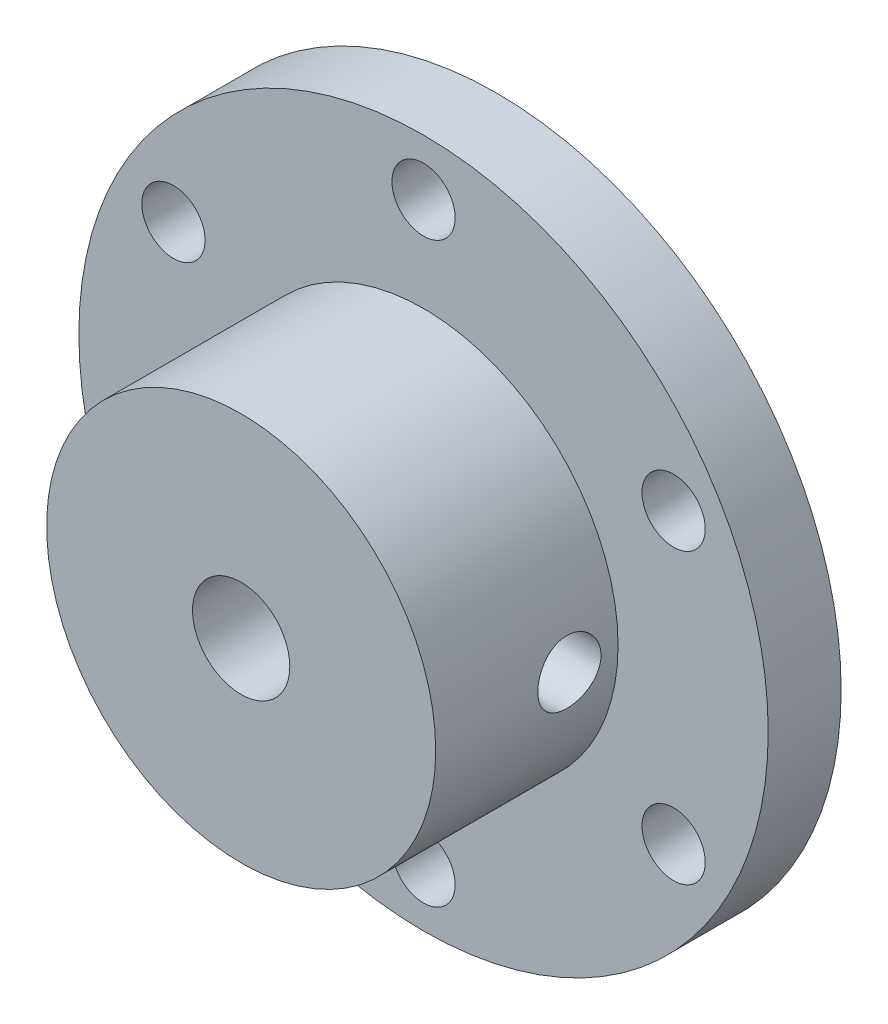
ISO-10303-21;
HEADER;
FILE_DESCRIPTION(('STEP AP214'),'2;1');
FILE_NAME('part.step','',(''),(''),'','','');
FILE_SCHEMA(('AUTOMOTIVE_DESIGN { 1 0 10303 214 1 1 1 1 }'));
ENDSEC;
DATA;
#1=APPLICATION_CONTEXT('core data for automotive mechanical design processes');
#2=APPLICATION_PROTOCOL_DEFINITION('international standard','automotive_design',2000,#1);
#3=PRODUCT_CONTEXT('',#1,'mechanical');
#4=PRODUCT('Part','Part','',(#3));
#5=PRODUCT_RELATED_PRODUCT_CATEGORY('part','',(#4));
#6=PRODUCT_DEFINITION_FORMATION('','',#4);
#7=PRODUCT_DEFINITION_CONTEXT('part definition',#1,'design');
#8=PRODUCT_DEFINITION('design','',#6,#7);
#9=PRODUCT_DEFINITION_SHAPE('','',#8);
#10=(LENGTH_UNIT() NAMED_UNIT(*) SI_UNIT(.MILLI.,.METRE.));
#11=(NAMED_UNIT(*) PLANE_ANGLE_UNIT() SI_UNIT($,.RADIAN.));
#12=(NAMED_UNIT(*) SI_UNIT($,.STERADIAN.) SOLID_ANGLE_UNIT());
#13=UNCERTAINTY_MEASURE_WITH_UNIT(LENGTH_MEASURE(1.E-05),#10,'distance_accuracy_value','');
#14=(GEOMETRIC_REPRESENTATION_CONTEXT(3) GLOBAL_UNCERTAINTY_ASSIGNED_CONTEXT((#13)) GLOBAL_UNIT_ASSIGNED_CONTEXT((#10,
#11,#12)) REPRESENTATION_CONTEXT('',''));
#15=CARTESIAN_POINT('',(0.,0.,0.));
#16=DIRECTION('',(0.,0.,1.));
#17=DIRECTION('',(1.,0.,0.));
#18=AXIS2_PLACEMENT_3D('',#15,#16,#17);
#19=CARTESIAN_POINT('',(0.,0.,6.));
#20=DIRECTION('',(0.,0.,-1.));
#21=DIRECTION('',(-1.,0.,0.));
#22=AXIS2_PLACEMENT_3D('',#19,#20,#21);
#23=CYLINDRICAL_SURFACE('',#22,28.35);
#24=CARTESIAN_POINT('',(0.,0.,6.));
#25=DIRECTION('',(0.,0.,1.));
#26=DIRECTION('',(1.,0.,0.));
#27=AXIS2_PLACEMENT_3D('',#24,#25,#26);
#28=CIRCLE('',#27,28.35);
#29=CARTESIAN_POINT('',(28.35,0.,6.));
#30=VERTEX_POINT('',#29);
#31=EDGE_CURVE('E51',#30,#30,#28,.T.);
#32=ORIENTED_EDGE('',*,*,#31,.F.);
#33=EDGE_LOOP('',(#32));
#34=FACE_BOUND('',#33,.T.);
#35=CARTESIAN_POINT('',(0.,0.,0.));
#36=DIRECTION('',(0.,0.,1.));
#37=DIRECTION('',(1.,0.,0.));
#38=AXIS2_PLACEMENT_3D('',#35,#36,#37);
#39=CIRCLE('',#38,28.35);
#40=CARTESIAN_POINT('',(28.35,0.,0.));
#41=VERTEX_POINT('',#40);
#42=EDGE_CURVE('E55',#41,#41,#39,.T.);
#43=ORIENTED_EDGE('',*,*,#42,.T.);
#44=EDGE_LOOP('',(#43));
#45=FACE_BOUND('',#44,.T.);
#46=ADVANCED_FACE('F45',(#34,#45),#23,.T.);
#47=CARTESIAN_POINT('',(0.,0.,6.));
#48=DIRECTION('',(0.,0.,1.));
#49=DIRECTION('',(1.,0.,0.));
#50=AXIS2_PLACEMENT_3D('',#47,#48,#49);
#51=PLANE('',#50);
#52=CARTESIAN_POINT('',(-20.5681033398804,-11.8750000000001,6.));
#53=DIRECTION('',(0.,0.,1.));
#54=DIRECTION('',(-0.500000000000004,0.866025403784436,0.));
#55=AXIS2_PLACEMENT_3D('',#52,#53,#54);
#56=CIRCLE('',#55,2.6);
#57=CARTESIAN_POINT('',(-21.8681033398804,-9.62333395016056,6.));
#58=VERTEX_POINT('',#57);
#59=EDGE_CURVE('E106',#58,#58,#56,.T.);
#60=ORIENTED_EDGE('',*,*,#59,.F.);
#61=EDGE_LOOP('',(#60));
#62=FACE_BOUND('',#61,.T.);
#63=CARTESIAN_POINT('',(0.,-23.75,6.));
#64=DIRECTION('',(0.,0.,1.));
#65=DIRECTION('',(-1.,0.,0.));
#66=AXIS2_PLACEMENT_3D('',#63,#64,#65);
#67=CIRCLE('',#66,2.6);
#68=CARTESIAN_POINT('',(-2.6,-23.75,6.));
#69=VERTEX_POINT('',#68);
#70=EDGE_CURVE('E100',#69,#69,#67,.T.);
#71=ORIENTED_EDGE('',*,*,#70,.F.);
#72=EDGE_LOOP('',(#71));
#73=FACE_BOUND('',#72,.T.);
#74=CARTESIAN_POINT('',(20.5681033398805,-11.8749999999998,6.));
#75=DIRECTION('',(0.,0.,1.));
#76=DIRECTION('',(-0.499999999999992,-0.866025403784443,0.));
#77=AXIS2_PLACEMENT_3D('',#74,#75,#76);
#78=CIRCLE('',#77,2.6);
#79=CARTESIAN_POINT('',(19.2681033398806,-14.1266660498394,6.));
#80=VERTEX_POINT('',#79);
#81=EDGE_CURVE('E92',#80,#80,#78,.T.);
#82=ORIENTED_EDGE('',*,*,#81,.F.);
#83=EDGE_LOOP('',(#82));
#84=FACE_BOUND('',#83,.T.);
#85=CARTESIAN_POINT('',(20.5681033398803,11.8750000000002,6.));
#86=DIRECTION('',(0.,0.,1.));
#87=DIRECTION('',(0.50000000000001,-0.866025403784433,0.));
#88=AXIS2_PLACEMENT_3D('',#85,#86,#87);
#89=CIRCLE('',#88,2.6);
#90=CARTESIAN_POINT('',(21.8681033398803,9.62333395016071,6.));
#91=VERTEX_POINT('',#90);
#92=EDGE_CURVE('E93',#91,#91,#89,.T.);
#93=ORIENTED_EDGE('',*,*,#92,.F.);
#94=EDGE_LOOP('',(#93));
#95=FACE_BOUND('',#94,.T.);
#96=CARTESIAN_POINT('',(-20.5681033398804,11.875,6.));
#97=DIRECTION('',(0.,0.,1.));
#98=DIRECTION('',(0.499999999999998,0.86602540378444,0.));
#99=AXIS2_PLACEMENT_3D('',#96,#97,#98);
#100=CIRCLE('',#99,2.6);
#101=CARTESIAN_POINT('',(-19.2681033398805,14.1266660498395,6.));
#102=VERTEX_POINT('',#101);
#103=EDGE_CURVE('E85',#102,#102,#100,.T.);
#104=ORIENTED_EDGE('',*,*,#103,.F.);
#105=EDGE_LOOP('',(#104));
#106=FACE_BOUND('',#105,.T.);
#107=CARTESIAN_POINT('',(0.,23.75,6.));
#108=DIRECTION('',(0.,0.,1.));
#109=DIRECTION('',(1.,0.,0.));
#110=AXIS2_PLACEMENT_3D('',#107,#108,#109);
#111=CIRCLE('',#110,2.6);
#112=CARTESIAN_POINT('',(2.6,23.75,6.));
#113=VERTEX_POINT('',#112);
#114=EDGE_CURVE('E79',#113,#113,#111,.T.);
#115=ORIENTED_EDGE('',*,*,#114,.F.);
#116=EDGE_LOOP('',(#115));
#117=FACE_BOUND('',#116,.T.);
#118=CARTESIAN_POINT('',(0.,0.,6.));
#119=DIRECTION('',(0.,0.,1.));
#120=DIRECTION('',(1.,0.,0.));
#121=AXIS2_PLACEMENT_3D('',#118,#119,#120);
#122=CIRCLE('',#121,16.);
#123=CARTESIAN_POINT('',(16.,0.,6.));
#124=VERTEX_POINT('',#123);
#125=EDGE_CURVE('E62',#124,#124,#122,.T.);
#126=ORIENTED_EDGE('',*,*,#125,.F.);
#127=EDGE_LOOP('',(#126));
#128=FACE_BOUND('',#127,.T.);
#129=ORIENTED_EDGE('',*,*,#31,.T.);
#130=EDGE_LOOP('',(#129));
#131=FACE_BOUND('',#130,.T.);
#132=ADVANCED_FACE('F174',(#62,#73,#84,#95,#106,#117,#128,#131),#51,.T.);
#133=CARTESIAN_POINT('',(0.,0.,0.));
#134=DIRECTION('',(0.,0.,1.));
#135=DIRECTION('',(1.,0.,0.));
#136=AXIS2_PLACEMENT_3D('',#133,#134,#135);
#137=PLANE('',#136);
#138=CARTESIAN_POINT('',(-20.5681033398804,-11.8750000000001,0.));
#139=DIRECTION('',(0.,0.,1.));
#140=DIRECTION('',(-0.500000000000004,0.866025403784436,0.));
#141=AXIS2_PLACEMENT_3D('',#138,#139,#140);
#142=CIRCLE('',#141,2.6);
#143=CARTESIAN_POINT('',(-21.8681033398804,-9.62333395016056,0.));
#144=VERTEX_POINT('',#143);
#145=EDGE_CURVE('E88',#144,#144,#142,.F.);
#146=ORIENTED_EDGE('',*,*,#145,.F.);
#147=EDGE_LOOP('',(#146));
#148=FACE_BOUND('',#147,.T.);
#149=CARTESIAN_POINT('',(0.,-23.75,0.));
#150=DIRECTION('',(0.,0.,1.));
#151=DIRECTION('',(-1.,0.,0.));
#152=AXIS2_PLACEMENT_3D('',#149,#150,#151);
#153=CIRCLE('',#152,2.6);
#154=CARTESIAN_POINT('',(-2.6,-23.75,0.));
#155=VERTEX_POINT('',#154);
#156=EDGE_CURVE('E103',#155,#155,#153,.F.);
#157=ORIENTED_EDGE('',*,*,#156,.F.);
#158=EDGE_LOOP('',(#157));
#159=FACE_BOUND('',#158,.T.);
#160=CARTESIAN_POINT('',(20.5681033398805,-11.8749999999998,0.));
#161=DIRECTION('',(0.,0.,1.));
#162=DIRECTION('',(-0.499999999999992,-0.866025403784443,0.));
#163=AXIS2_PLACEMENT_3D('',#160,#161,#162);
#164=CIRCLE('',#163,2.6);
#165=CARTESIAN_POINT('',(19.2681033398806,-14.1266660498394,0.));
#166=VERTEX_POINT('',#165);
#167=EDGE_CURVE('E97',#166,#166,#164,.F.);
#168=ORIENTED_EDGE('',*,*,#167,.F.);
#169=EDGE_LOOP('',(#168));
#170=FACE_BOUND('',#169,.T.);
#171=CARTESIAN_POINT('',(20.5681033398803,11.8750000000002,0.));
#172=DIRECTION('',(0.,0.,1.));
#173=DIRECTION('',(0.50000000000001,-0.866025403784433,0.));
#174=AXIS2_PLACEMENT_3D('',#171,#172,#173);
#175=CIRCLE('',#174,2.6);
#176=CARTESIAN_POINT('',(21.8681033398803,9.62333395016071,0.));
#177=VERTEX_POINT('',#176);
#178=EDGE_CURVE('E89',#177,#177,#175,.F.);
#179=ORIENTED_EDGE('',*,*,#178,.F.);
#180=EDGE_LOOP('',(#179));
#181=FACE_BOUND('',#180,.T.);
#182=CARTESIAN_POINT('',(-20.5681033398804,11.875,0.));
#183=DIRECTION('',(0.,0.,1.));
#184=DIRECTION('',(0.499999999999998,0.86602540378444,0.));
#185=AXIS2_PLACEMENT_3D('',#182,#183,#184);
#186=CIRCLE('',#185,2.6);
#187=CARTESIAN_POINT('',(-19.2681033398805,14.1266660498395,0.));
#188=VERTEX_POINT('',#187);
#189=EDGE_CURVE('E82',#188,#188,#186,.F.);
#190=ORIENTED_EDGE('',*,*,#189,.F.);
#191=EDGE_LOOP('',(#190));
#192=FACE_BOUND('',#191,.T.);
#193=CARTESIAN_POINT('',(0.,23.75,0.));
#194=DIRECTION('',(0.,0.,1.));
#195=DIRECTION('',(1.,0.,0.));
#196=AXIS2_PLACEMENT_3D('',#193,#194,#195);
#197=CIRCLE('',#196,2.6);
#198=CARTESIAN_POINT('',(2.6,23.75,0.));
#199=VERTEX_POINT('',#198);
#200=EDGE_CURVE('E74',#199,#199,#197,.F.);
#201=ORIENTED_EDGE('',*,*,#200,.F.);
#202=EDGE_LOOP('',(#201));
#203=FACE_BOUND('',#202,.T.);
#204=CARTESIAN_POINT('',(0.,0.,0.));
#205=DIRECTION('',(0.,0.,1.));
#206=DIRECTION('',(1.,0.,0.));
#207=AXIS2_PLACEMENT_3D('',#204,#205,#206);
#208=CIRCLE('',#207,11.);
#209=CARTESIAN_POINT('',(11.,0.,0.));
#210=VERTEX_POINT('',#209);
#211=EDGE_CURVE('E12',#210,#210,#208,.F.);
#212=ORIENTED_EDGE('',*,*,#211,.F.);
#213=EDGE_LOOP('',(#212));
#214=FACE_BOUND('',#213,.T.);
#215=ORIENTED_EDGE('',*,*,#42,.F.);
#216=EDGE_LOOP('',(#215));
#217=FACE_BOUND('',#216,.T.);
#218=ADVANCED_FACE('F172',(#148,#159,#170,#181,#192,#203,#214,#217),#137,.F.);
#219=CARTESIAN_POINT('',(0.,0.,21.));
#220=DIRECTION('',(0.,0.,-1.));
#221=DIRECTION('',(-1.,0.,0.));
#222=AXIS2_PLACEMENT_3D('',#219,#220,#221);
#223=CYLINDRICAL_SURFACE('',#222,16.);
#224=CARTESIAN_POINT('',(16.,0.,7.4));
#225=CARTESIAN_POINT('',(15.9999975518525,0.145019165622541,7.400005860033));
#226=CARTESIAN_POINT('',(15.998007815557,0.290118777639167,7.41217399437673));
#227=CARTESIAN_POINT('',(15.9902619371879,0.576252000590273,7.46050684932739));
#228=CARTESIAN_POINT('',(15.9845022787969,0.717281687035817,7.49669397359803));
#229=CARTESIAN_POINT('',(15.9698628987647,0.991093594297769,7.59194634492627));
#230=CARTESIAN_POINT('',(15.9609856797801,1.12388233031244,7.65099324492504));
#231=CARTESIAN_POINT('',(15.941088512354,1.37764964720681,7.79024181657666));
#232=CARTESIAN_POINT('',(15.9300688225734,1.49862965111127,7.87044093493452));
#233=CARTESIAN_POINT('',(15.9069970915093,1.72646494930587,8.05049468884231));
#234=CARTESIAN_POINT('',(15.8949373686679,1.83319709427538,8.15050418657474));
#235=CARTESIAN_POINT('',(15.8712039142321,2.02844349150952,8.3670064758371));
#236=CARTESIAN_POINT('',(15.859530206462,2.1169566210824,8.48350028241674));
#237=CARTESIAN_POINT('',(15.8378161048365,2.27374233291168,8.73050557038933));
#238=CARTESIAN_POINT('',(15.8277856376571,2.34189381199137,8.86109487026781));
#239=CARTESIAN_POINT('',(15.8105998564937,2.45524735239402,9.13205768923801));
#240=CARTESIAN_POINT('',(15.8034443581267,2.50045088550628,9.27243058019251));
#241=CARTESIAN_POINT('',(15.7928949187579,2.5662387819247,9.55767306751007));
#242=CARTESIAN_POINT('',(15.7894685806565,2.58703530727345,9.70249251051031));
#243=CARTESIAN_POINT('',(15.7866673145195,2.60407651839143,9.99360287646867));
#244=CARTESIAN_POINT('',(15.7872921138754,2.60032285618713,10.1398936997535));
#245=CARTESIAN_POINT('',(15.792492936895,2.5685432048478,10.4282837553786));
#246=CARTESIAN_POINT('',(15.7970302480111,2.54075501837767,10.5704099922873));
#247=CARTESIAN_POINT('',(15.8094842884277,2.46206807385545,10.8479556544906));
#248=CARTESIAN_POINT('',(15.8174011283977,2.41116855897298,10.9833748599879));
#249=CARTESIAN_POINT('',(15.8357642622092,2.28746109805666,11.2443773241013));
#250=CARTESIAN_POINT('',(15.8462219734499,2.2145538916015,11.3699126999328));
#251=CARTESIAN_POINT('',(15.8684805204019,2.04897114492228,11.6070579521655));
#252=CARTESIAN_POINT('',(15.8802814592449,1.95629408631178,11.7186667579184));
#253=CARTESIAN_POINT('',(15.9040671416711,1.75250422023619,11.9261676650082));
#254=CARTESIAN_POINT('',(15.9160524138607,1.64118727022561,12.0218593275903));
#255=CARTESIAN_POINT('',(15.9387277836054,1.40396930678376,12.1932351460248));
#256=CARTESIAN_POINT('',(15.9494178735614,1.27806820779389,12.268919184493));
#257=CARTESIAN_POINT('',(15.9683124927782,1.01507117727731,12.3981475356042));
#258=CARTESIAN_POINT('',(15.9765150982258,0.877966684577824,12.4516747238223));
#259=CARTESIAN_POINT('',(15.9894949378792,0.596550991776668,12.5348869796715));
#260=CARTESIAN_POINT('',(15.9942724443176,0.452240365405991,12.564573942186));
#261=CARTESIAN_POINT('',(15.9998273274762,0.162237052175142,12.5989926713094));
#262=CARTESIAN_POINT('',(16.0006488246688,0.0165778499538006,12.6039997024925));
#263=CARTESIAN_POINT('',(15.9983197787696,-0.273498686511127,12.5896494658514));
#264=CARTESIAN_POINT('',(15.995169380715,-0.417916065907044,12.5702930876776));
#265=CARTESIAN_POINT('',(15.9852778322002,-0.700563507141241,12.5079944292099));
#266=CARTESIAN_POINT('',(15.9785573499514,-0.838824267874382,12.4651878644649));
#267=CARTESIAN_POINT('',(15.9622763015789,-1.10620674757079,12.357348226564));
#268=CARTESIAN_POINT('',(15.9527155825726,-1.2353279741128,12.292313956919));
#269=CARTESIAN_POINT('',(15.9317056456613,-1.48196559776625,12.1412305759297));
#270=CARTESIAN_POINT('',(15.9202411780516,-1.59937491764035,12.0550088262938));
#271=CARTESIAN_POINT('',(15.8967429940485,-1.81815609227847,11.8642362281294));
#272=CARTESIAN_POINT('',(15.8847092385126,-1.91952684218722,11.759684117915));
#273=CARTESIAN_POINT('',(15.861286806495,-2.10436883201893,11.5339864162734));
#274=CARTESIAN_POINT('',(15.8499056278516,-2.1876544619935,11.4126879142364));
#275=CARTESIAN_POINT('',(15.8292151115576,-2.33266734053808,11.1576604671493));
#276=CARTESIAN_POINT('',(15.8199057106323,-2.39439524754049,11.0239319019056));
#277=CARTESIAN_POINT('',(15.8044685529145,-2.49426022583075,10.7483683048658));
#278=CARTESIAN_POINT('',(15.7983281672888,-2.53249105346396,10.6065679898655));
#279=CARTESIAN_POINT('',(15.789892100647,-2.58457259245705,10.3184507365549));
#280=CARTESIAN_POINT('',(15.7875961034369,-2.5984253088787,10.1721341707066));
#281=CARTESIAN_POINT('',(15.7871219367981,-2.60130360164379,9.88099032581017));
#282=CARTESIAN_POINT('',(15.7888953245053,-2.59062124754973,9.73616592977366));
#283=CARTESIAN_POINT('',(15.7962541732009,-2.54536271366947,9.45040383344645));
#284=CARTESIAN_POINT('',(15.8018396235564,-2.51078660053051,9.30946612231569));
#285=CARTESIAN_POINT('',(15.8161752287004,-2.41883172557042,9.03558276759314));
#286=CARTESIAN_POINT('',(15.8249220621644,-2.36147688867156,8.90262890654861));
#287=CARTESIAN_POINT('',(15.8445983040299,-2.22562239095935,8.6481834323924));
#288=CARTESIAN_POINT('',(15.855527811869,-2.14712176673498,8.52669234187001));
#289=CARTESIAN_POINT('',(15.8784920726711,-1.97015676038599,8.29714327721146));
#290=CARTESIAN_POINT('',(15.8905379049704,-1.87147711552398,8.18925234016369));
#291=CARTESIAN_POINT('',(15.9142881228198,-1.65740958299184,7.99145994230406));
#292=CARTESIAN_POINT('',(15.9259924288051,-1.54201783868795,7.90156264530333));
#293=CARTESIAN_POINT('',(15.9478291613459,-1.29690761070655,7.74177541359853));
#294=CARTESIAN_POINT('',(15.9579508180885,-1.1671004465741,7.67202003835235));
#295=CARTESIAN_POINT('',(15.9753768765635,-0.897501815361569,7.55541067805837));
#296=CARTESIAN_POINT('',(15.9826841117636,-0.757720558855373,7.50853364706595));
#297=CARTESIAN_POINT('',(15.9920442535747,-0.514478104994399,7.44930629219604));
#298=CARTESIAN_POINT('',(15.9950118750673,-0.412496524331958,7.43084568967443));
#299=CARTESIAN_POINT('',(15.9989906066281,-0.207023613848418,7.40619054922839));
#300=CARTESIAN_POINT('',(16.0000017477853,-0.103532308043563,7.39999581639614));
#301=CARTESIAN_POINT('',(16.,0.,7.4));
#302=B_SPLINE_CURVE_WITH_KNOTS('',3,(#224,#225,#226,#227,#228,#229,#230,#231,#232,#233,#234,
#235,#236,#237,#238,#239,#240,#241,#242,#243,#244,#245,#246,#247,#248,#249,#250,#251,#252,#253,
#254,#255,#256,#257,#258,#259,#260,#261,#262,#263,#264,#265,#266,#267,#268,#269,#270,#271,#272,
#273,#274,#275,#276,#277,#278,#279,#280,#281,#282,#283,#284,#285,#286,#287,#288,#289,#290,#291,
#292,#293,#294,#295,#296,#297,#298,#299,#300,#301),.UNSPECIFIED.,.T.,.F.,(4,2,2,2,2,2,2,2,2,2,2,
2,2,2,2,2,2,2,2,2,2,2,2,2,2,2,2,2,2,2,2,2,2,2,2,2,2,2,4),(0.,0.434679088417318,
0.869764193703607,1.30450082494282,1.73918500290158,2.17741177975745,2.61566555293407,
3.05647624757063,3.49725866680267,3.93418044388563,4.37107282001553,4.80369130704004,
5.23632396211356,5.67093782244235,6.10558507449936,6.54534792691676,6.98511335935419,
7.42521804273336,7.86528774197792,8.30043789444196,8.73557215749171,9.16821432936311,
9.60087979348197,10.0371949046106,10.4735400592753,10.9141714688839,11.3547894192148,
11.7936376358453,12.2324497562046,12.6660652990585,13.0996796324263,13.5328397318637,
13.9660195695974,14.4040871007936,14.8422558859345,15.2832875284259,15.7238739867125,
16.0342056881841,16.344532458366),.UNSPECIFIED.);
#303=CARTESIAN_POINT('',(16.,0.,7.4));
#304=VERTEX_POINT('',#303);
#305=EDGE_CURVE('E96',#304,#304,#302,.T.);
#306=ORIENTED_EDGE('',*,*,#305,.F.);
#307=EDGE_LOOP('',(#306));
#308=FACE_BOUND('',#307,.T.);
#309=CARTESIAN_POINT('',(0.,0.,21.));
#310=DIRECTION('',(0.,0.,1.));
#311=DIRECTION('',(1.,0.,0.));
#312=AXIS2_PLACEMENT_3D('',#309,#310,#311);
#313=CIRCLE('',#312,16.);
#314=CARTESIAN_POINT('',(16.,0.,21.));
#315=VERTEX_POINT('',#314);
#316=EDGE_CURVE('E60',#315,#315,#313,.T.);
#317=ORIENTED_EDGE('',*,*,#316,.F.);
#318=EDGE_LOOP('',(#317));
#319=FACE_BOUND('',#318,.T.);
#320=ORIENTED_EDGE('',*,*,#125,.T.);
#321=EDGE_LOOP('',(#320));
#322=FACE_BOUND('',#321,.T.);
#323=ADVANCED_FACE('F168',(#308,#319,#322),#223,.T.);
#324=CARTESIAN_POINT('',(0.,0.,21.));
#325=DIRECTION('',(0.,0.,1.));
#326=DIRECTION('',(1.,0.,0.));
#327=AXIS2_PLACEMENT_3D('',#324,#325,#326);
#328=PLANE('',#327);
#329=CARTESIAN_POINT('',(0.,0.,21.));
#330=DIRECTION('',(0.,0.,1.));
#331=DIRECTION('',(1.,0.,0.));
#332=AXIS2_PLACEMENT_3D('',#329,#330,#331);
#333=CIRCLE('',#332,4.);
#334=CARTESIAN_POINT('',(4.,0.,21.));
#335=VERTEX_POINT('',#334);
#336=EDGE_CURVE('E71',#335,#335,#333,.T.);
#337=ORIENTED_EDGE('',*,*,#336,.F.);
#338=EDGE_LOOP('',(#337));
#339=FACE_BOUND('',#338,.T.);
#340=ORIENTED_EDGE('',*,*,#316,.T.);
#341=EDGE_LOOP('',(#340));
#342=FACE_BOUND('',#341,.T.);
#343=ADVANCED_FACE('F164',(#339,#342),#328,.T.);
#344=CARTESIAN_POINT('',(0.,0.,-5.));
#345=DIRECTION('',(0.,0.,1.));
#346=DIRECTION('',(1.,0.,0.));
#347=AXIS2_PLACEMENT_3D('',#344,#345,#346);
#348=CYLINDRICAL_SURFACE('',#347,11.);
#349=CARTESIAN_POINT('',(0.,0.,-5.));
#350=DIRECTION('',(0.,0.,-1.));
#351=DIRECTION('',(-1.,0.,0.));
#352=AXIS2_PLACEMENT_3D('',#349,#350,#351);
#353=CIRCLE('',#352,11.);
#354=CARTESIAN_POINT('',(-11.,0.,-5.));
#355=VERTEX_POINT('',#354);
#356=EDGE_CURVE('E65',#355,#355,#353,.T.);
#357=ORIENTED_EDGE('',*,*,#356,.F.);
#358=EDGE_LOOP('',(#357));
#359=FACE_BOUND('',#358,.T.);
#360=ORIENTED_EDGE('',*,*,#211,.T.);
#361=EDGE_LOOP('',(#360));
#362=FACE_BOUND('',#361,.T.);
#363=ADVANCED_FACE('F160',(#359,#362),#348,.T.);
#364=CARTESIAN_POINT('',(0.,0.,-5.));
#365=DIRECTION('',(0.,0.,-1.));
#366=DIRECTION('',(-1.,0.,0.));
#367=AXIS2_PLACEMENT_3D('',#364,#365,#366);
#368=PLANE('',#367);
#369=CARTESIAN_POINT('',(0.,0.,-5.));
#370=DIRECTION('',(0.,0.,1.));
#371=DIRECTION('',(1.,0.,0.));
#372=AXIS2_PLACEMENT_3D('',#369,#370,#371);
#373=CIRCLE('',#372,4.);
#374=CARTESIAN_POINT('',(4.,0.,-5.));
#375=VERTEX_POINT('',#374);
#376=EDGE_CURVE('E70',#375,#375,#373,.T.);
#377=ORIENTED_EDGE('',*,*,#376,.T.);
#378=EDGE_LOOP('',(#377));
#379=FACE_BOUND('',#378,.T.);
#380=ORIENTED_EDGE('',*,*,#356,.T.);
#381=EDGE_LOOP('',(#380));
#382=FACE_BOUND('',#381,.T.);
#383=ADVANCED_FACE('F156',(#379,#382),#368,.T.);
#384=CARTESIAN_POINT('',(0.,0.,-5.));
#385=DIRECTION('',(0.,0.,1.));
#386=DIRECTION('',(1.,0.,0.));
#387=AXIS2_PLACEMENT_3D('',#384,#385,#386);
#388=CYLINDRICAL_SURFACE('',#387,4.);
#389=CARTESIAN_POINT('',(4.00000000000001,0.,7.4));
#390=CARTESIAN_POINT('',(3.99999329691887,-0.131242329840402,7.40000738126002));
#391=CARTESIAN_POINT('',(3.99347988058591,-0.26254087997631,7.40999708649455));
#392=CARTESIAN_POINT('',(3.96805748738894,-0.52099139192231,7.44937287000064));
#393=CARTESIAN_POINT('',(3.94913797434839,-0.648139732626245,7.47877543525755));
#394=CARTESIAN_POINT('',(3.90078759906248,-0.894153597137369,7.55520688955142));
#395=CARTESIAN_POINT('',(3.87140638518175,-1.01305512679099,7.60215257495925));
#396=CARTESIAN_POINT('',(3.8045247484509,-1.24084842839767,7.71170628677316));
#397=CARTESIAN_POINT('',(3.76702351965728,-1.3497392052146,7.77431586797862));
#398=CARTESIAN_POINT('',(3.68325347012659,-1.56461434967278,7.91910183329293));
#399=CARTESIAN_POINT('',(3.63651545151144,-1.66960870737682,8.00247034493663));
#400=CARTESIAN_POINT('',(3.54025458179931,-1.86507260364924,8.18360410574952));
#401=CARTESIAN_POINT('',(3.49072792339419,-1.9555216008489,8.28138934774511));
#402=CARTESIAN_POINT('',(3.38558669465042,-2.13305930241868,8.50552739909667));
#403=CARTESIAN_POINT('',(3.33016214511496,-2.21764773761769,8.63396599830677));
#404=CARTESIAN_POINT('',(3.22801420162754,-2.36387198159628,8.90642481317717));
#405=CARTESIAN_POINT('',(3.18127587306569,-2.42554737172189,9.05041759878877));
#406=CARTESIAN_POINT('',(3.11539311765711,-2.50925136145637,9.30955747553016));
#407=CARTESIAN_POINT('',(3.09219132576584,-2.53752995825082,9.42164521861647));
#408=CARTESIAN_POINT('',(3.05771041530277,-2.57898335699173,9.65029679368884));
#409=CARTESIAN_POINT('',(3.04641228509143,-2.59218224597557,9.7668531791267));
#410=CARTESIAN_POINT('',(3.03746806038309,-2.60266135280388,10.0016298561429));
#411=CARTESIAN_POINT('',(3.03986891717852,-2.59988682378099,10.1198544831345));
#412=CARTESIAN_POINT('',(3.05803219832116,-2.57849148954916,10.3538522603983));
#413=CARTESIAN_POINT('',(3.07380580320714,-2.55985742462454,10.46962327624));
#414=CARTESIAN_POINT('',(3.11558534759959,-2.50881501786101,10.6916580375893));
#415=CARTESIAN_POINT('',(3.14121548827324,-2.4769094003533,10.7981125106191));
#416=CARTESIAN_POINT('',(3.19981705285506,-2.40072387206794,11.0043007802708));
#417=CARTESIAN_POINT('',(3.23279089307918,-2.35643988717874,11.1040323507368));
#418=CARTESIAN_POINT('',(3.31021385739157,-2.24673614480251,11.3148988685634));
#419=CARTESIAN_POINT('',(3.3556433242705,-2.17886980217695,11.4243987256045));
#420=CARTESIAN_POINT('',(3.44875456395806,-2.02828712582731,11.631714922157));
#421=CARTESIAN_POINT('',(3.49643900487366,-1.94555285901557,11.7295169122504));
#422=CARTESIAN_POINT('',(3.59951924333919,-1.74873460092104,11.9301085195407));
#423=CARTESIAN_POINT('',(3.65461273597688,-1.63168281359842,12.0301736971629));
#424=CARTESIAN_POINT('',(3.75705675925733,-1.37948895098043,12.2092655039682));
#425=CARTESIAN_POINT('',(3.80441521846604,-1.24436566112746,12.2883137288184));
#426=CARTESIAN_POINT('',(3.87810197822686,-0.987177593697824,12.4086200970024));
#427=CARTESIAN_POINT('',(3.90673767899132,-0.867825846065371,12.4542618689402));
#428=CARTESIAN_POINT('',(3.95335158387484,-0.621803922247494,12.5278062967084));
#429=CARTESIAN_POINT('',(3.97133854602048,-0.495139854433106,12.5557235314094));
#430=CARTESIAN_POINT('',(3.99505026067922,-0.237423817982841,12.5924169717052));
#431=CARTESIAN_POINT('',(4.00072966012438,-0.106357421515167,12.6011223843623));
#432=CARTESIAN_POINT('',(3.99911931552079,0.155513974751281,12.5986452674804));
#433=CARTESIAN_POINT('',(3.9918293542577,0.286318970135309,12.5874624048472));
#434=CARTESIAN_POINT('',(3.96581617517835,0.535832409189388,12.5471382819573));
#435=CARTESIAN_POINT('',(3.94779725175815,0.654798018157413,12.5191023253737));
#436=CARTESIAN_POINT('',(3.90242300909489,0.885994589797185,12.4473811532236));
#437=CARTESIAN_POINT('',(3.87506617651225,0.998224457378542,12.4036934010065));
#438=CARTESIAN_POINT('',(3.81084256295547,1.22143058424602,12.2987741796295));
#439=CARTESIAN_POINT('',(3.77344664526003,1.3317766276134,12.2365337702525));
#440=CARTESIAN_POINT('',(3.69298130183549,1.54093180569865,12.097926552364));
#441=CARTESIAN_POINT('',(3.64990778597085,1.63973252544577,12.0215495436746));
#442=CARTESIAN_POINT('',(3.55409295784261,1.83914998324802,11.8433890522977));
#443=CARTESIAN_POINT('',(3.50088886534182,1.93766759539933,11.7395021130206));
#444=CARTESIAN_POINT('',(3.3956438319936,2.11669261988643,11.5165942077913));
#445=CARTESIAN_POINT('',(3.34360337235282,2.19719270088575,11.3975671120893));
#446=CARTESIAN_POINT('',(3.25220537921942,2.32999289851312,11.1607308489132));
#447=CARTESIAN_POINT('',(3.21207543674154,2.38451159546739,11.0444705590162));
#448=CARTESIAN_POINT('',(3.14178831224712,2.4763952519929,10.8025770418024));
#449=CARTESIAN_POINT('',(3.11161319411396,2.51379111036201,10.6769611772152));
#450=CARTESIAN_POINT('',(3.0692934895664,2.56522627052098,10.4383770125928));
#451=CARTESIAN_POINT('',(3.05511753152745,2.58193539978499,10.3263540057634));
#452=CARTESIAN_POINT('',(3.03930433313111,2.6005371868811,10.1002347008403));
#453=CARTESIAN_POINT('',(3.03765740728438,2.60244128967071,9.98614007261254));
#454=CARTESIAN_POINT('',(3.04714201327667,2.59132574649897,9.75933297558345));
#455=CARTESIAN_POINT('',(3.05826410933804,2.57831712043633,9.64661954830303));
#456=CARTESIAN_POINT('',(3.09162789439484,2.53820790097824,9.42538703012019));
#457=CARTESIAN_POINT('',(3.11388388764562,2.51108917785943,9.31687352877944));
#458=CARTESIAN_POINT('',(3.17455377484889,2.43418115457623,9.07522359122063));
#459=CARTESIAN_POINT('',(3.21579043461171,2.38007932598737,8.94417788011513));
#460=CARTESIAN_POINT('',(3.30612081416593,2.25291901658979,8.69460918405456));
#461=CARTESIAN_POINT('',(3.35522523949556,2.17983462114018,8.57610363240639));
#462=CARTESIAN_POINT('',(3.45667900495331,2.01515794084205,8.35110588997306));
#463=CARTESIAN_POINT('',(3.50906686476138,1.92329614569848,8.24482856708459));
#464=CARTESIAN_POINT('',(3.61161392590105,1.72305889643047,8.04786851587868));
#465=CARTESIAN_POINT('',(3.66177258968263,1.61467948684425,7.95718953398671));
#466=CARTESIAN_POINT('',(3.76028651184461,1.37081527561855,7.78522804376525));
#467=CARTESIAN_POINT('',(3.80795408931363,1.23370112020267,7.70580535149122));
#468=CARTESIAN_POINT('',(3.8693611012282,1.01672423622726,7.6057087030814));
#469=CARTESIAN_POINT('',(3.88814289000377,0.942542349294445,7.57552330986037));
#470=CARTESIAN_POINT('',(3.92179078701731,0.790932764694422,7.5219198025447));
#471=CARTESIAN_POINT('',(3.93665878835666,0.713506657344975,7.49849841616152));
#472=CARTESIAN_POINT('',(3.96583403439342,0.531962182410129,7.45279703410458));
#473=CARTESIAN_POINT('',(3.97857524969429,0.426930692841303,7.43306300572254));
#474=CARTESIAN_POINT('',(3.99565973196604,0.214611549942163,7.40666340225019));
#475=CARTESIAN_POINT('',(4.00000548150374,0.107324573055882,7.3999939639095));
#476=CARTESIAN_POINT('',(4.00000000000001,0.,7.4));
#477=B_SPLINE_CURVE_WITH_KNOTS('',3,(#389,#390,#391,#392,#393,#394,#395,#396,#397,#398,#399,
#400,#401,#402,#403,#404,#405,#406,#407,#408,#409,#410,#411,#412,#413,#414,#415,#416,#417,#418,
#419,#420,#421,#422,#423,#424,#425,#426,#427,#428,#429,#430,#431,#432,#433,#434,#435,#436,#437,
#438,#439,#440,#441,#442,#443,#444,#445,#446,#447,#448,#449,#450,#451,#452,#453,#454,#455,#456,
#457,#458,#459,#460,#461,#462,#463,#464,#465,#466,#467,#468,#469,#470,#471,#472,#473,#474,#475,
#476),.UNSPECIFIED.,.T.,.F.,(4,2,2,2,2,2,2,2,2,2,2,2,2,2,2,2,2,2,2,2,2,2,2,2,2,2,2,2,2,2,2,2,2,
2,2,2,2,2,2,2,2,2,2,4),(0.,0.393303969432377,0.786942395104627,1.1787370878649,1.57057068563366,
1.99490086832629,2.419825137127,2.90794425842807,3.39521620935952,3.74750251178101,
4.09922531195304,4.45215431353109,4.80537867939459,5.1462917867135,5.48731723168751,
5.89565988937284,6.30449842018327,6.79278996236955,7.28057781136886,7.67176869156947,
8.06263738930539,8.45494399662145,8.8472571744554,9.21628489699287,9.58537245408335,
9.98013330852133,10.3751801185911,10.8315540068116,11.288113257406,11.6902028988748,
12.0915640670411,12.4324642576701,12.7731008907508,13.1134859694145,13.4543094846403,
13.8949021129378,14.3360994206592,14.7841406255338,15.2322892916033,15.7254702477647,
15.9718878198455,16.2181859796628,16.5399089195223,16.8615367102804),.UNSPECIFIED.);
#478=CARTESIAN_POINT('',(4.00000000000001,0.,7.4));
#479=VERTEX_POINT('',#478);
#480=EDGE_CURVE('E120',#479,#479,#477,.T.);
#481=ORIENTED_EDGE('',*,*,#480,.F.);
#482=EDGE_LOOP('',(#481));
#483=FACE_BOUND('',#482,.T.);
#484=ORIENTED_EDGE('',*,*,#376,.F.);
#485=EDGE_LOOP('',(#484));
#486=FACE_BOUND('',#485,.T.);
#487=ORIENTED_EDGE('',*,*,#336,.T.);
#488=EDGE_LOOP('',(#487));
#489=FACE_BOUND('',#488,.T.);
#490=ADVANCED_FACE('F152',(#483,#486,#489),#388,.F.);
#491=CARTESIAN_POINT('',(0.,23.75,-5.001));
#492=DIRECTION('',(0.,0.,1.));
#493=DIRECTION('',(1.,0.,0.));
#494=AXIS2_PLACEMENT_3D('',#491,#492,#493);
#495=CYLINDRICAL_SURFACE('',#494,2.6);
#496=ORIENTED_EDGE('',*,*,#114,.T.);
#497=EDGE_LOOP('',(#496));
#498=FACE_BOUND('',#497,.T.);
#499=ORIENTED_EDGE('',*,*,#200,.T.);
#500=EDGE_LOOP('',(#499));
#501=FACE_BOUND('',#500,.T.);
#502=ADVANCED_FACE('F148',(#498,#501),#495,.F.);
#503=CARTESIAN_POINT('',(-20.5681033398804,11.875,-5.001));
#504=DIRECTION('',(0.,0.,1.));
#505=DIRECTION('',(0.499999999999998,0.86602540378444,0.));
#506=AXIS2_PLACEMENT_3D('',#503,#504,#505);
#507=CYLINDRICAL_SURFACE('',#506,2.6);
#508=ORIENTED_EDGE('',*,*,#103,.T.);
#509=EDGE_LOOP('',(#508));
#510=FACE_BOUND('',#509,.T.);
#511=ORIENTED_EDGE('',*,*,#189,.T.);
#512=EDGE_LOOP('',(#511));
#513=FACE_BOUND('',#512,.T.);
#514=ADVANCED_FACE('F144',(#510,#513),#507,.F.);
#515=CARTESIAN_POINT('',(20.5681033398803,11.8750000000002,-5.001));
#516=DIRECTION('',(0.,0.,1.));
#517=DIRECTION('',(0.50000000000001,-0.866025403784433,0.));
#518=AXIS2_PLACEMENT_3D('',#515,#516,#517);
#519=CYLINDRICAL_SURFACE('',#518,2.6);
#520=ORIENTED_EDGE('',*,*,#92,.T.);
#521=EDGE_LOOP('',(#520));
#522=FACE_BOUND('',#521,.T.);
#523=ORIENTED_EDGE('',*,*,#178,.T.);
#524=EDGE_LOOP('',(#523));
#525=FACE_BOUND('',#524,.T.);
#526=ADVANCED_FACE('F140',(#522,#525),#519,.F.);
#527=CARTESIAN_POINT('',(20.5681033398805,-11.8749999999998,-5.001));
#528=DIRECTION('',(0.,0.,1.));
#529=DIRECTION('',(-0.499999999999992,-0.866025403784443,0.));
#530=AXIS2_PLACEMENT_3D('',#527,#528,#529);
#531=CYLINDRICAL_SURFACE('',#530,2.6);
#532=ORIENTED_EDGE('',*,*,#81,.T.);
#533=EDGE_LOOP('',(#532));
#534=FACE_BOUND('',#533,.T.);
#535=ORIENTED_EDGE('',*,*,#167,.T.);
#536=EDGE_LOOP('',(#535));
#537=FACE_BOUND('',#536,.T.);
#538=ADVANCED_FACE('F136',(#534,#537),#531,.F.);
#539=CARTESIAN_POINT('',(0.,-23.75,-5.001));
#540=DIRECTION('',(0.,0.,1.));
#541=DIRECTION('',(-1.,0.,0.));
#542=AXIS2_PLACEMENT_3D('',#539,#540,#541);
#543=CYLINDRICAL_SURFACE('',#542,2.6);
#544=ORIENTED_EDGE('',*,*,#70,.T.);
#545=EDGE_LOOP('',(#544));
#546=FACE_BOUND('',#545,.T.);
#547=ORIENTED_EDGE('',*,*,#156,.T.);
#548=EDGE_LOOP('',(#547));
#549=FACE_BOUND('',#548,.T.);
#550=ADVANCED_FACE('F132',(#546,#549),#543,.F.);
#551=CARTESIAN_POINT('',(-20.5681033398804,-11.8750000000001,-5.001));
#552=DIRECTION('',(0.,0.,1.));
#553=DIRECTION('',(-0.500000000000004,0.866025403784436,0.));
#554=AXIS2_PLACEMENT_3D('',#551,#552,#553);
#555=CYLINDRICAL_SURFACE('',#554,2.6);
#556=ORIENTED_EDGE('',*,*,#59,.T.);
#557=EDGE_LOOP('',(#556));
#558=FACE_BOUND('',#557,.T.);
#559=ORIENTED_EDGE('',*,*,#145,.T.);
#560=EDGE_LOOP('',(#559));
#561=FACE_BOUND('',#560,.T.);
#562=ADVANCED_FACE('F129',(#558,#561),#555,.F.);
#563=CARTESIAN_POINT('',(-28.351,0.,10.));
#564=DIRECTION('',(1.,0.,0.));
#565=DIRECTION('',(0.,0.,-1.));
#566=AXIS2_PLACEMENT_3D('',#563,#564,#565);
#567=CYLINDRICAL_SURFACE('',#566,2.6);
#568=ORIENTED_EDGE('',*,*,#480,.T.);
#569=EDGE_LOOP('',(#568));
#570=FACE_BOUND('',#569,.T.);
#571=ORIENTED_EDGE('',*,*,#305,.T.);
#572=EDGE_LOOP('',(#571));
#573=FACE_BOUND('',#572,.T.);
#574=ADVANCED_FACE('F125',(#570,#573),#567,.F.);
#575=CLOSED_SHELL('',(#46,#132,#218,#323,#343,#363,#383,#490,#502,#514,#526,#538,#550,#562,#574));
#576=MANIFOLD_SOLID_BREP('B2',#575);
#577=ADVANCED_BREP_SHAPE_REPRESENTATION('',(#18,#576),#14);
#578=SHAPE_DEFINITION_REPRESENTATION(#9,#577);
ENDSEC;
END-ISO-10303-21;
